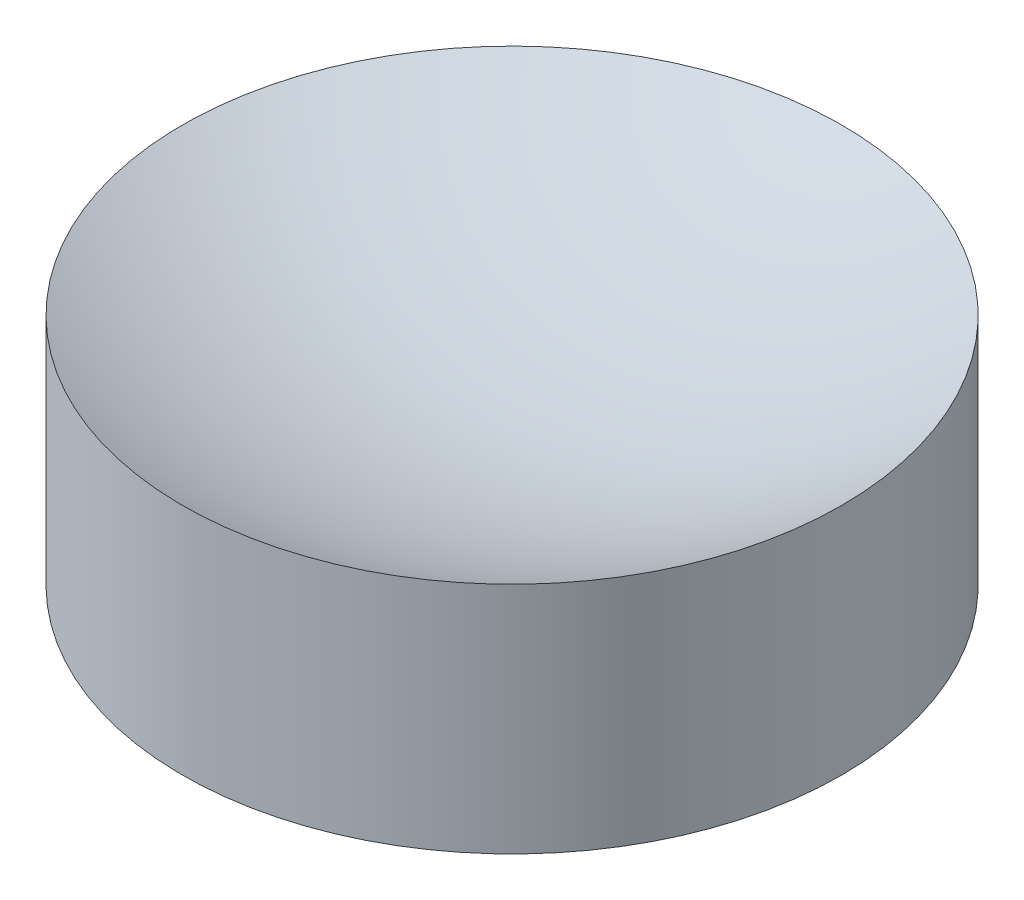
ISO-10303-21;
HEADER;
FILE_DESCRIPTION(('STEP AP214'),'2;1');
FILE_NAME('part.step','',(''),(''),'','','');
FILE_SCHEMA(('AUTOMOTIVE_DESIGN { 1 0 10303 214 1 1 1 1 }'));
ENDSEC;
DATA;
#1=APPLICATION_CONTEXT('core data for automotive mechanical design processes');
#2=APPLICATION_PROTOCOL_DEFINITION('international standard','automotive_design',2000,#1);
#3=PRODUCT_CONTEXT('',#1,'mechanical');
#4=PRODUCT('Part','Part','',(#3));
#5=PRODUCT_RELATED_PRODUCT_CATEGORY('part','',(#4));
#6=PRODUCT_DEFINITION_FORMATION('','',#4);
#7=PRODUCT_DEFINITION_CONTEXT('part definition',#1,'design');
#8=PRODUCT_DEFINITION('design','',#6,#7);
#9=PRODUCT_DEFINITION_SHAPE('','',#8);
#10=(LENGTH_UNIT() NAMED_UNIT(*) SI_UNIT(.MILLI.,.METRE.));
#11=(NAMED_UNIT(*) PLANE_ANGLE_UNIT() SI_UNIT($,.RADIAN.));
#12=(NAMED_UNIT(*) SI_UNIT($,.STERADIAN.) SOLID_ANGLE_UNIT());
#13=UNCERTAINTY_MEASURE_WITH_UNIT(LENGTH_MEASURE(1.E-05),#10,'distance_accuracy_value','');
#14=(GEOMETRIC_REPRESENTATION_CONTEXT(3) GLOBAL_UNCERTAINTY_ASSIGNED_CONTEXT((#13)) GLOBAL_UNIT_ASSIGNED_CONTEXT((#10,
#11,#12)) REPRESENTATION_CONTEXT('',''));
#15=CARTESIAN_POINT('',(0.,0.,0.));
#16=DIRECTION('',(0.,0.,1.));
#17=DIRECTION('',(1.,0.,0.));
#18=AXIS2_PLACEMENT_3D('',#15,#16,#17);
#19=CARTESIAN_POINT('',(6.25277607468888E-13,5388.89198160114,-699.260009999996));
#20=DIRECTION('',(0.,0.,-1.));
#21=DIRECTION('',(0.,-1.,0.));
#22=AXIS2_PLACEMENT_3D('',#19,#20,#21);
#23=SPHERICAL_SURFACE('',#22,369.783263973143);
#24=CARTESIAN_POINT('',(-7.51175579473995E-13,5026.18595419791,-699.260009999996));
#25=DIRECTION('',(0.,-1.,0.));
#26=DIRECTION('',(1.,0.,0.));
#27=AXIS2_PLACEMENT_3D('',#24,#25,#26);
#28=CIRCLE('',#27,72.);
#29=CARTESIAN_POINT('',(71.9999999999993,5026.18595419791,-699.260009999996));
#30=VERTEX_POINT('',#29);
#31=EDGE_CURVE('E19',#30,#30,#28,.F.);
#32=ORIENTED_EDGE('',*,*,#31,.F.);
#33=EDGE_LOOP('',(#32));
#34=FACE_BOUND('',#33,.T.);
#35=ADVANCED_FACE('F15',(#34),#23,.T.);
#36=CARTESIAN_POINT('',(-3.41060513164848E-13,5214.53318307978,-699.260009999996));
#37=DIRECTION('',(0.,0.,1.));
#38=DIRECTION('',(0.,-1.,0.));
#39=AXIS2_PLACEMENT_3D('',#36,#37,#38);
#40=SPHERICAL_SURFACE('',#39,155.049163581832);
#41=CARTESIAN_POINT('',(-1.06581410364004E-13,5077.21514665549,-699.260009999996));
#42=DIRECTION('',(0.,-1.,0.));
#43=DIRECTION('',(1.,0.,0.));
#44=AXIS2_PLACEMENT_3D('',#41,#42,#43);
#45=CIRCLE('',#44,72.);
#46=CARTESIAN_POINT('',(71.9999999999999,5077.21514665549,-699.260009999996));
#47=VERTEX_POINT('',#46);
#48=EDGE_CURVE('E10',#47,#47,#45,.T.);
#49=ORIENTED_EDGE('',*,*,#48,.F.);
#50=EDGE_LOOP('',(#49));
#51=FACE_BOUND('',#50,.T.);
#52=ADVANCED_FACE('F30',(#51),#40,.F.);
#53=CARTESIAN_POINT('',(-1.06581410364015E-13,5077.21514665549,-699.260009999996));
#54=DIRECTION('',(0.,-1.,0.));
#55=DIRECTION('',(1.,0.,0.));
#56=AXIS2_PLACEMENT_3D('',#53,#54,#55);
#57=CYLINDRICAL_SURFACE('',#56,72.);
#58=ORIENTED_EDGE('',*,*,#48,.T.);
#59=EDGE_LOOP('',(#58));
#60=FACE_BOUND('',#59,.T.);
#61=ORIENTED_EDGE('',*,*,#31,.T.);
#62=EDGE_LOOP('',(#61));
#63=FACE_BOUND('',#62,.T.);
#64=ADVANCED_FACE('F17',(#60,#63),#57,.T.);
#65=CLOSED_SHELL('',(#35,#52,#64));
#66=MANIFOLD_SOLID_BREP('B1',#65);
#67=ADVANCED_BREP_SHAPE_REPRESENTATION('',(#18,#66),#14);
#68=SHAPE_DEFINITION_REPRESENTATION(#9,#67);
ENDSEC;
END-ISO-10303-21;
